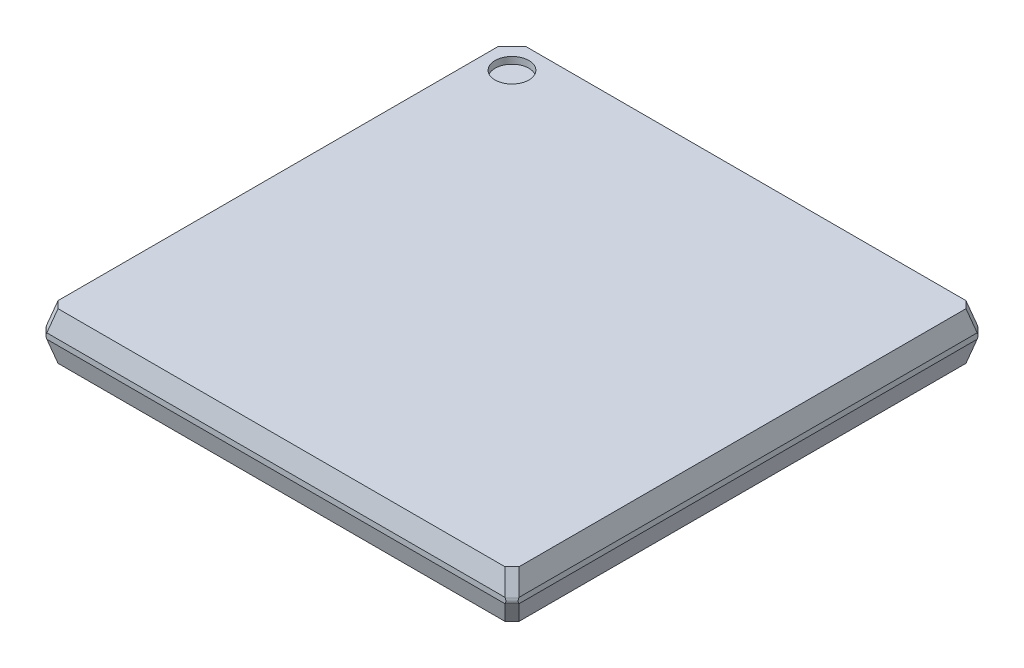
ISO-10303-21;
HEADER;
FILE_DESCRIPTION(('STEP AP214'),'2;1');
FILE_NAME('part.step','',(''),(''),'','','');
FILE_SCHEMA(('AUTOMOTIVE_DESIGN { 1 0 10303 214 1 1 1 1 }'));
ENDSEC;
DATA;
#1=APPLICATION_CONTEXT('core data for automotive mechanical design processes');
#2=APPLICATION_PROTOCOL_DEFINITION('international standard','automotive_design',2000,#1);
#3=PRODUCT_CONTEXT('',#1,'mechanical');
#4=PRODUCT('Part','Part','',(#3));
#5=PRODUCT_RELATED_PRODUCT_CATEGORY('part','',(#4));
#6=PRODUCT_DEFINITION_FORMATION('','',#4);
#7=PRODUCT_DEFINITION_CONTEXT('part definition',#1,'design');
#8=PRODUCT_DEFINITION('design','',#6,#7);
#9=PRODUCT_DEFINITION_SHAPE('','',#8);
#10=(LENGTH_UNIT() NAMED_UNIT(*) SI_UNIT(.MILLI.,.METRE.));
#11=(NAMED_UNIT(*) PLANE_ANGLE_UNIT() SI_UNIT($,.RADIAN.));
#12=(NAMED_UNIT(*) SI_UNIT($,.STERADIAN.) SOLID_ANGLE_UNIT());
#13=UNCERTAINTY_MEASURE_WITH_UNIT(LENGTH_MEASURE(1.E-05),#10,'distance_accuracy_value','');
#14=(GEOMETRIC_REPRESENTATION_CONTEXT(3) GLOBAL_UNCERTAINTY_ASSIGNED_CONTEXT((#13)) GLOBAL_UNIT_ASSIGNED_CONTEXT((#10,
#11,#12)) REPRESENTATION_CONTEXT('',''));
#15=CARTESIAN_POINT('',(0.,0.,0.));
#16=DIRECTION('',(0.,0.,1.));
#17=DIRECTION('',(1.,0.,0.));
#18=AXIS2_PLACEMENT_3D('',#15,#16,#17);
#19=CARTESIAN_POINT('',(-6.,0.5,-6.));
#20=DIRECTION('',(0.,1.,0.));
#21=DIRECTION('',(0.,0.,1.));
#22=AXIS2_PLACEMENT_3D('',#19,#20,#21);
#23=PLANE('',#22);
#24=CARTESIAN_POINT('',(-6.,0.5,-6.));
#25=DIRECTION('',(0.,-1.,0.));
#26=DIRECTION('',(0.,0.,-1.));
#27=AXIS2_PLACEMENT_3D('',#24,#25,#26);
#28=CIRCLE('',#27,0.5);
#29=CARTESIAN_POINT('',(-6.,0.5,-6.5));
#30=VERTEX_POINT('',#29);
#31=EDGE_CURVE('E19',#30,#30,#28,.F.);
#32=ORIENTED_EDGE('',*,*,#31,.T.);
#33=EDGE_LOOP('',(#32));
#34=FACE_BOUND('',#33,.T.);
#35=ADVANCED_FACE('F16',(#34),#23,.T.);
#36=CARTESIAN_POINT('',(-6.,0.7,-6.));
#37=DIRECTION('',(0.,-1.,0.));
#38=DIRECTION('',(0.,0.,-1.));
#39=AXIS2_PLACEMENT_3D('',#36,#37,#38);
#40=CYLINDRICAL_SURFACE('',#39,0.5);
#41=CARTESIAN_POINT('',(-6.,0.7,-6.));
#42=DIRECTION('',(0.,-1.,0.));
#43=DIRECTION('',(0.,0.,-1.));
#44=AXIS2_PLACEMENT_3D('',#41,#42,#43);
#45=CIRCLE('',#44,0.5);
#46=CARTESIAN_POINT('',(-6.,0.7,-6.5));
#47=VERTEX_POINT('',#46);
#48=EDGE_CURVE('E321',#47,#47,#45,.T.);
#49=ORIENTED_EDGE('',*,*,#48,.F.);
#50=EDGE_LOOP('',(#49));
#51=FACE_BOUND('',#50,.T.);
#52=ORIENTED_EDGE('',*,*,#31,.F.);
#53=EDGE_LOOP('',(#52));
#54=FACE_BOUND('',#53,.T.);
#55=ADVANCED_FACE('F376',(#51,#54),#40,.F.);
#56=CARTESIAN_POINT('',(0.,0.7,0.));
#57=DIRECTION('',(0.,1.,0.));
#58=DIRECTION('',(0.,0.,1.));
#59=AXIS2_PLACEMENT_3D('',#56,#57,#58);
#60=PLANE('',#59);
#61=ORIENTED_EDGE('',*,*,#48,.T.);
#62=EDGE_LOOP('',(#61));
#63=FACE_BOUND('',#62,.T.);
#64=DIRECTION('',(0.707106781186548,0.,0.707106781186548));
#65=VECTOR('',#64,1.);
#66=CARTESIAN_POINT('',(-6.70914048806276,0.699999999999998,6.70914048806276));
#67=LINE('',#66,#65);
#68=CARTESIAN_POINT('',(-6.60584541082731,0.699999999999998,6.81243556529822));
#69=VERTEX_POINT('',#68);
#70=CARTESIAN_POINT('',(-6.81243556529822,0.699999999999999,6.60584541082731));
#71=VERTEX_POINT('',#70);
#72=EDGE_CURVE('E296',#69,#71,#67,.F.);
#73=ORIENTED_EDGE('',*,*,#72,.F.);
#74=DIRECTION('',(1.,0.,0.));
#75=VECTOR('',#74,1.);
#76=CARTESIAN_POINT('',(-3.5,0.699999999999999,6.81243556529822));
#77=LINE('',#76,#75);
#78=CARTESIAN_POINT('',(6.60584541082731,0.699999999999999,6.81243556529822));
#79=VERTEX_POINT('',#78);
#80=EDGE_CURVE('E302',#79,#69,#77,.F.);
#81=ORIENTED_EDGE('',*,*,#80,.F.);
#82=DIRECTION('',(0.707106781186548,0.,-0.707106781186548));
#83=VECTOR('',#82,1.);
#84=CARTESIAN_POINT('',(6.60584541082731,0.7,6.81243556529822));
#85=LINE('',#84,#83);
#86=CARTESIAN_POINT('',(6.81243556529822,0.699999999999999,6.60584541082731));
#87=VERTEX_POINT('',#86);
#88=EDGE_CURVE('E328',#79,#87,#85,.T.);
#89=ORIENTED_EDGE('',*,*,#88,.T.);
#90=DIRECTION('',(0.,0.,1.));
#91=VECTOR('',#90,1.);
#92=CARTESIAN_POINT('',(6.81243556529822,0.699999999999999,3.5));
#93=LINE('',#92,#91);
#94=CARTESIAN_POINT('',(6.81243556529822,0.7,-6.60584541082732));
#95=VERTEX_POINT('',#94);
#96=EDGE_CURVE('E231',#95,#87,#93,.T.);
#97=ORIENTED_EDGE('',*,*,#96,.F.);
#98=DIRECTION('',(-0.70710678118655,0.,-0.707106781186545));
#99=VECTOR('',#98,1.);
#100=CARTESIAN_POINT('',(6.70914048806277,0.700000000000003,-6.70914048806276));
#101=LINE('',#100,#99);
#102=CARTESIAN_POINT('',(6.60584541082731,0.700000000000002,-6.81243556529822));
#103=VERTEX_POINT('',#102);
#104=EDGE_CURVE('E244',#103,#95,#101,.F.);
#105=ORIENTED_EDGE('',*,*,#104,.F.);
#106=DIRECTION('',(1.,0.,0.));
#107=VECTOR('',#106,1.);
#108=CARTESIAN_POINT('',(3.5,0.699999999999999,-6.81243556529822));
#109=LINE('',#108,#107);
#110=CARTESIAN_POINT('',(-6.39925525635641,0.7,-6.81243556529822));
#111=VERTEX_POINT('',#110);
#112=EDGE_CURVE('E257',#111,#103,#109,.T.);
#113=ORIENTED_EDGE('',*,*,#112,.F.);
#114=DIRECTION('',(-0.707106781186547,0.,0.707106781186548));
#115=VECTOR('',#114,1.);
#116=CARTESIAN_POINT('',(-6.60584541082731,0.699999999999999,-6.60584541082731));
#117=LINE('',#116,#115);
#118=CARTESIAN_POINT('',(-6.81243556529822,0.699999999999999,-6.39925525635641));
#119=VERTEX_POINT('',#118);
#120=EDGE_CURVE('E270',#119,#111,#117,.F.);
#121=ORIENTED_EDGE('',*,*,#120,.F.);
#122=DIRECTION('',(0.,0.,1.));
#123=VECTOR('',#122,1.);
#124=CARTESIAN_POINT('',(-6.81243556529822,0.699999999999999,-3.5));
#125=LINE('',#124,#123);
#126=EDGE_CURVE('E283',#71,#119,#125,.F.);
#127=ORIENTED_EDGE('',*,*,#126,.F.);
#128=EDGE_LOOP('',(#73,#81,#89,#97,#105,#113,#121,#127));
#129=FACE_BOUND('',#128,.T.);
#130=ADVANCED_FACE('F373',(#63,#129),#60,.T.);
#131=CARTESIAN_POINT('',(-3.5,0.35,6.90621778264911));
#132=DIRECTION('',(0.,0.258819045102521,0.965925826289068));
#133=DIRECTION('',(0.,-0.965925826289068,0.258819045102521));
#134=AXIS2_PLACEMENT_3D('',#131,#132,#133);
#135=PLANE('',#134);
#136=ORIENTED_EDGE('',*,*,#80,.T.);
#137=DIRECTION('',(0.250562807085732,0.93511312653103,-0.250562807085732));
#138=VECTOR('',#137,1.);
#139=CARTESIAN_POINT('',(-6.2790134803474,1.91975337008685,6.4856036348183));
#140=LINE('',#139,#138);
#141=CARTESIAN_POINT('',(-6.77141022669538,0.0821036952345704,6.97800038116629));
#142=VERTEX_POINT('',#141);
#143=EDGE_CURVE('E299',#142,#69,#140,.T.);
#144=ORIENTED_EDGE('',*,*,#143,.F.);
#145=DIRECTION('',(1.,0.,0.));
#146=VECTOR('',#145,1.);
#147=CARTESIAN_POINT('',(-3.5,0.0821036952345708,6.97800038116629));
#148=LINE('',#147,#146);
#149=CARTESIAN_POINT('',(6.77141022669538,0.0821036952345713,6.97800038116629));
#150=VERTEX_POINT('',#149);
#151=EDGE_CURVE('E305',#150,#142,#148,.F.);
#152=ORIENTED_EDGE('',*,*,#151,.F.);
#153=DIRECTION('',(-0.250562807085731,0.93511312653103,-0.250562807085731));
#154=VECTOR('',#153,1.);
#155=CARTESIAN_POINT('',(6.2790134803474,1.91975337008684,6.48560363481831));
#156=LINE('',#155,#154);
#157=EDGE_CURVE('E218',#79,#150,#156,.F.);
#158=ORIENTED_EDGE('',*,*,#157,.F.);
#159=EDGE_LOOP('',(#136,#144,#152,#158));
#160=FACE_BOUND('',#159,.T.);
#161=ADVANCED_FACE('F478',(#160),#135,.T.);
#162=CARTESIAN_POINT('',(-6.38230855758285,1.91975337008685,6.38230855758285));
#163=DIRECTION('',(-0.661224832946645,0.354349320006915,0.661224832946645));
#164=DIRECTION('',(0.707106781186548,0.,0.707106781186548));
#165=AXIS2_PLACEMENT_3D('',#162,#163,#164);
#166=PLANE('',#165);
#167=ORIENTED_EDGE('',*,*,#72,.T.);
#168=DIRECTION('',(0.250562807085732,0.935113126531029,-0.250562807085731));
#169=VECTOR('',#168,1.);
#170=CARTESIAN_POINT('',(-6.97800038116629,0.0821036952345706,6.77141022669538));
#171=LINE('',#170,#169);
#172=CARTESIAN_POINT('',(-6.97800038116629,0.082103695234571,6.77141022669538));
#173=VERTEX_POINT('',#172);
#174=EDGE_CURVE('E293',#173,#71,#171,.T.);
#175=ORIENTED_EDGE('',*,*,#174,.F.);
#176=DIRECTION('',(0.,0.881412416655406,-0.472347490483095));
#177=VECTOR('',#176,1.);
#178=CARTESIAN_POINT('',(-6.97800038116629,0.0708698640013826,6.77743041870906));
#179=LINE('',#178,#177);
#180=CARTESIAN_POINT('',(-6.97800038116629,0.0708698640013788,6.77743041870907));
#181=VERTEX_POINT('',#180);
#182=EDGE_CURVE('E290',#181,#173,#179,.T.);
#183=ORIENTED_EDGE('',*,*,#182,.F.);
#184=DIRECTION('',(-0.707106781186548,0.,-0.707106781186548));
#185=VECTOR('',#184,1.);
#186=CARTESIAN_POINT('',(-6.87771539993768,0.0708698640013844,6.87771539993768));
#187=LINE('',#186,#185);
#188=CARTESIAN_POINT('',(-6.77743041870907,0.0708698640013796,6.97800038116629));
#189=VERTEX_POINT('',#188);
#190=EDGE_CURVE('E369',#189,#181,#187,.T.);
#191=ORIENTED_EDGE('',*,*,#190,.F.);
#192=DIRECTION('',(-0.472347490483105,-0.8814124166554,0.));
#193=VECTOR('',#192,1.);
#194=CARTESIAN_POINT('',(-6.77141022669538,0.0821036952345708,6.97800038116629));
#195=LINE('',#194,#193);
#196=EDGE_CURVE('E308',#142,#189,#195,.T.);
#197=ORIENTED_EDGE('',*,*,#196,.F.);
#198=ORIENTED_EDGE('',*,*,#143,.T.);
#199=EDGE_LOOP('',(#167,#175,#183,#191,#197,#198));
#200=FACE_BOUND('',#199,.T.);
#201=ADVANCED_FACE('F474',(#200),#166,.T.);
#202=CARTESIAN_POINT('',(-6.90621778264911,0.35,-3.5));
#203=DIRECTION('',(-0.965925826289068,0.258819045102521,0.));
#204=DIRECTION('',(-0.258819045102521,-0.965925826289068,0.));
#205=AXIS2_PLACEMENT_3D('',#202,#203,#204);
#206=PLANE('',#205);
#207=ORIENTED_EDGE('',*,*,#126,.T.);
#208=DIRECTION('',(0.250562807085731,0.93511312653103,0.250562807085731));
#209=VECTOR('',#208,1.);
#210=CARTESIAN_POINT('',(-6.49857372011194,1.87134835279253,-6.08539341117013));
#211=LINE('',#210,#209);
#212=CARTESIAN_POINT('',(-6.97800038116629,0.0821036952345714,-6.56482007222448));
#213=VERTEX_POINT('',#212);
#214=EDGE_CURVE('E280',#213,#119,#211,.T.);
#215=ORIENTED_EDGE('',*,*,#214,.F.);
#216=DIRECTION('',(0.,0.,1.));
#217=VECTOR('',#216,1.);
#218=CARTESIAN_POINT('',(-6.97800038116629,0.0821036952345711,-3.5));
#219=LINE('',#218,#217);
#220=EDGE_CURVE('E286',#173,#213,#219,.F.);
#221=ORIENTED_EDGE('',*,*,#220,.F.);
#222=ORIENTED_EDGE('',*,*,#174,.T.);
#223=EDGE_LOOP('',(#207,#215,#221,#222));
#224=FACE_BOUND('',#223,.T.);
#225=ADVANCED_FACE('F470',(#224),#206,.T.);
#226=CARTESIAN_POINT('',(-6.29198356564103,1.87134835279253,-6.29198356564103));
#227=DIRECTION('',(-0.661224832946645,0.354349320006915,-0.661224832946645));
#228=DIRECTION('',(-0.707106781186547,0.,0.707106781186548));
#229=AXIS2_PLACEMENT_3D('',#226,#227,#228);
#230=PLANE('',#229);
#231=ORIENTED_EDGE('',*,*,#120,.T.);
#232=DIRECTION('',(0.250562807085728,0.93511312653103,0.250562807085732));
#233=VECTOR('',#232,1.);
#234=CARTESIAN_POINT('',(-6.56482007222448,0.0821036952345708,-6.97800038116629));
#235=LINE('',#234,#233);
#236=CARTESIAN_POINT('',(-6.56482007222448,0.082103695234571,-6.97800038116629));
#237=VERTEX_POINT('',#236);
#238=EDGE_CURVE('E267',#237,#111,#235,.T.);
#239=ORIENTED_EDGE('',*,*,#238,.F.);
#240=DIRECTION('',(0.472347490483115,0.881412416655395,0.));
#241=VECTOR('',#240,1.);
#242=CARTESIAN_POINT('',(-6.57084026423816,0.0708698640013832,-6.97800038116629));
#243=LINE('',#242,#241);
#244=CARTESIAN_POINT('',(-6.57084026423816,0.0708698640013806,-6.97800038116629));
#245=VERTEX_POINT('',#244);
#246=EDGE_CURVE('E264',#245,#237,#243,.T.);
#247=ORIENTED_EDGE('',*,*,#246,.F.);
#248=DIRECTION('',(0.707106781186548,0.,-0.707106781186547));
#249=VECTOR('',#248,1.);
#250=CARTESIAN_POINT('',(-6.77442032270222,0.070869864001383,-6.77442032270223));
#251=LINE('',#250,#249);
#252=CARTESIAN_POINT('',(-6.97800038116629,0.0708698640013806,-6.57084026423816));
#253=VERTEX_POINT('',#252);
#254=EDGE_CURVE('E362',#253,#245,#251,.T.);
#255=ORIENTED_EDGE('',*,*,#254,.F.);
#256=DIRECTION('',(0.,-0.881412416655395,-0.472347490483115));
#257=VECTOR('',#256,1.);
#258=CARTESIAN_POINT('',(-6.97800038116629,0.0821036952345711,-6.56482007222448));
#259=LINE('',#258,#257);
#260=EDGE_CURVE('E289',#213,#253,#259,.T.);
#261=ORIENTED_EDGE('',*,*,#260,.F.);
#262=ORIENTED_EDGE('',*,*,#214,.T.);
#263=EDGE_LOOP('',(#231,#239,#247,#255,#261,#262));
#264=FACE_BOUND('',#263,.T.);
#265=ADVANCED_FACE('F466',(#264),#230,.T.);
#266=CARTESIAN_POINT('',(3.5,0.35,-6.90621778264911));
#267=DIRECTION('',(0.,0.258819045102521,-0.965925826289068));
#268=DIRECTION('',(0.,0.965925826289068,0.258819045102521));
#269=AXIS2_PLACEMENT_3D('',#266,#267,#268);
#270=PLANE('',#269);
#271=ORIENTED_EDGE('',*,*,#112,.T.);
#272=DIRECTION('',(-0.25056280708573,0.93511312653103,0.250562807085732));
#273=VECTOR('',#272,1.);
#274=CARTESIAN_POINT('',(6.2790134803474,1.91975337008685,-6.48560363481831));
#275=LINE('',#274,#273);
#276=CARTESIAN_POINT('',(6.77141022669538,0.0821036952345713,-6.97800038116629));
#277=VERTEX_POINT('',#276);
#278=EDGE_CURVE('E254',#277,#103,#275,.T.);
#279=ORIENTED_EDGE('',*,*,#278,.F.);
#280=DIRECTION('',(-1.,0.,0.));
#281=VECTOR('',#280,1.);
#282=CARTESIAN_POINT('',(3.5,0.0821036952345711,-6.97800038116629));
#283=LINE('',#282,#281);
#284=EDGE_CURVE('E260',#237,#277,#283,.F.);
#285=ORIENTED_EDGE('',*,*,#284,.F.);
#286=ORIENTED_EDGE('',*,*,#238,.T.);
#287=EDGE_LOOP('',(#271,#279,#285,#286));
#288=FACE_BOUND('',#287,.T.);
#289=ADVANCED_FACE('F462',(#288),#270,.T.);
#290=CARTESIAN_POINT('',(6.38230855758286,1.91975337008685,-6.38230855758285));
#291=DIRECTION('',(0.661224832946643,0.354349320006914,-0.661224832946647));
#292=DIRECTION('',(-0.70710678118655,0.,-0.707106781186545));
#293=AXIS2_PLACEMENT_3D('',#290,#291,#292);
#294=PLANE('',#293);
#295=ORIENTED_EDGE('',*,*,#104,.T.);
#296=DIRECTION('',(-0.25056280708573,0.93511312653103,0.250562807085731));
#297=VECTOR('',#296,1.);
#298=CARTESIAN_POINT('',(6.97800038116629,0.0821036952345711,-6.77141022669538));
#299=LINE('',#298,#297);
#300=CARTESIAN_POINT('',(6.97800038116629,0.0821036952345716,-6.77141022669538));
#301=VERTEX_POINT('',#300);
#302=EDGE_CURVE('E241',#301,#95,#299,.T.);
#303=ORIENTED_EDGE('',*,*,#302,.F.);
#304=DIRECTION('',(0.,0.881412416655397,0.472347490483112));
#305=VECTOR('',#304,1.);
#306=CARTESIAN_POINT('',(6.97800038116629,0.0708698640013836,-6.77743041870906));
#307=LINE('',#306,#305);
#308=CARTESIAN_POINT('',(6.97800038116629,0.0708698640013795,-6.77743041870906));
#309=VERTEX_POINT('',#308);
#310=EDGE_CURVE('E238',#309,#301,#307,.T.);
#311=ORIENTED_EDGE('',*,*,#310,.F.);
#312=DIRECTION('',(-0.707106781186549,0.,-0.707106781186546));
#313=VECTOR('',#312,1.);
#314=CARTESIAN_POINT('',(6.87771539993768,0.0708698640013808,-6.87771539993767));
#315=LINE('',#314,#313);
#316=CARTESIAN_POINT('',(6.77743041870904,0.0708698640014305,-6.97800038116629));
#317=VERTEX_POINT('',#316);
#318=EDGE_CURVE('E354',#317,#309,#315,.F.);
#319=ORIENTED_EDGE('',*,*,#318,.F.);
#320=DIRECTION('',(0.47234749048371,-0.881412416655076,0.));
#321=VECTOR('',#320,1.);
#322=CARTESIAN_POINT('',(6.77141022669538,0.0821036952345711,-6.97800038116629));
#323=LINE('',#322,#321);
#324=EDGE_CURVE('E263',#277,#317,#323,.T.);
#325=ORIENTED_EDGE('',*,*,#324,.F.);
#326=ORIENTED_EDGE('',*,*,#278,.T.);
#327=EDGE_LOOP('',(#295,#303,#311,#319,#325,#326));
#328=FACE_BOUND('',#327,.T.);
#329=ADVANCED_FACE('F458',(#328),#294,.T.);
#330=CARTESIAN_POINT('',(6.90621778264911,0.35,3.5));
#331=DIRECTION('',(0.965925826289069,0.258819045102519,0.));
#332=DIRECTION('',(-0.258819045102519,0.965925826289069,0.));
#333=AXIS2_PLACEMENT_3D('',#330,#331,#332);
#334=PLANE('',#333);
#335=ORIENTED_EDGE('',*,*,#96,.T.);
#336=DIRECTION('',(-0.250562807085731,0.93511312653103,-0.250562807085731));
#337=VECTOR('',#336,1.);
#338=CARTESIAN_POINT('',(6.48560363481831,1.91975337008684,6.2790134803474));
#339=LINE('',#338,#337);
#340=CARTESIAN_POINT('',(6.97800038116629,0.082103695234571,6.77141022669538));
#341=VERTEX_POINT('',#340);
#342=EDGE_CURVE('E228',#341,#87,#339,.T.);
#343=ORIENTED_EDGE('',*,*,#342,.F.);
#344=DIRECTION('',(0.,0.,-1.));
#345=VECTOR('',#344,1.);
#346=CARTESIAN_POINT('',(6.97800038116629,0.0821036952345716,3.5));
#347=LINE('',#346,#345);
#348=EDGE_CURVE('E234',#301,#341,#347,.F.);
#349=ORIENTED_EDGE('',*,*,#348,.F.);
#350=ORIENTED_EDGE('',*,*,#302,.T.);
#351=EDGE_LOOP('',(#335,#343,#349,#350));
#352=FACE_BOUND('',#351,.T.);
#353=ADVANCED_FACE('F454',(#352),#334,.T.);
#354=CARTESIAN_POINT('',(6.38230855758286,1.91975337008684,6.38230855758285));
#355=DIRECTION('',(0.661224832946645,0.354349320006914,0.661224832946645));
#356=DIRECTION('',(0.707106781186548,0.,-0.707106781186548));
#357=AXIS2_PLACEMENT_3D('',#354,#355,#356);
#358=PLANE('',#357);
#359=DIRECTION('',(-0.472347490483131,0.881412416655386,0.));
#360=VECTOR('',#359,1.);
#361=CARTESIAN_POINT('',(6.77743041870906,0.0708698640013834,6.97800038116629));
#362=LINE('',#361,#360);
#363=CARTESIAN_POINT('',(6.77743041870906,0.0708698640013824,6.97800038116629));
#364=VERTEX_POINT('',#363);
#365=EDGE_CURVE('E187',#364,#150,#362,.T.);
#366=ORIENTED_EDGE('',*,*,#365,.F.);
#367=DIRECTION('',(0.707106781186547,0.,-0.707106781186548));
#368=VECTOR('',#367,1.);
#369=CARTESIAN_POINT('',(6.87771539993768,0.070869864001383,6.87771539993767));
#370=LINE('',#369,#368);
#371=CARTESIAN_POINT('',(6.97800038116629,0.0708698640013791,6.77743041870906));
#372=VERTEX_POINT('',#371);
#373=EDGE_CURVE('E183',#372,#364,#370,.F.);
#374=ORIENTED_EDGE('',*,*,#373,.F.);
#375=DIRECTION('',(0.,-0.881412416655405,0.472347490483096));
#376=VECTOR('',#375,1.);
#377=CARTESIAN_POINT('',(6.97800038116629,0.0821036952345719,6.77141022669538));
#378=LINE('',#377,#376);
#379=EDGE_CURVE('E237',#341,#372,#378,.T.);
#380=ORIENTED_EDGE('',*,*,#379,.F.);
#381=ORIENTED_EDGE('',*,*,#342,.T.);
#382=ORIENTED_EDGE('',*,*,#88,.F.);
#383=ORIENTED_EDGE('',*,*,#157,.T.);
#384=EDGE_LOOP('',(#366,#374,#380,#381,#382,#383));
#385=FACE_BOUND('',#384,.T.);
#386=ADVANCED_FACE('F451',(#385),#358,.T.);
#387=CARTESIAN_POINT('',(6.74547043334835,0.,6.74547043334834));
#388=DIRECTION('',(0.707106781186547,0.,-0.707106781186548));
#389=DIRECTION('',(-0.707106781186548,0.,-0.707106781186547));
#390=AXIS2_PLACEMENT_3D('',#387,#388,#389);
#391=CYLINDRICAL_SURFACE('',#390,0.2);
#392=CARTESIAN_POINT('',(6.5129404855304,0.,6.97800038116629));
#393=DIRECTION('',(0.,0.,1.));
#394=DIRECTION('',(1.,0.,0.));
#395=AXIS2_PLACEMENT_3D('',#392,#393,#394);
#396=ELLIPSE('',#395,0.282842712474619,0.2);
#397=CARTESIAN_POINT('',(6.77743041870906,-0.0708698640013771,6.97800038116629));
#398=VERTEX_POINT('',#397);
#399=EDGE_CURVE('E176',#398,#364,#396,.T.);
#400=ORIENTED_EDGE('',*,*,#399,.F.);
#401=DIRECTION('',(0.707106781186548,0.,-0.707106781186548));
#402=VECTOR('',#401,1.);
#403=CARTESIAN_POINT('',(6.87771539993768,-0.0708698640013812,6.87771539993767));
#404=LINE('',#403,#402);
#405=CARTESIAN_POINT('',(6.97800038116629,-0.0708698640013795,6.77743041870906));
#406=VERTEX_POINT('',#405);
#407=EDGE_CURVE('E181',#406,#398,#404,.F.);
#408=ORIENTED_EDGE('',*,*,#407,.F.);
#409=CARTESIAN_POINT('',(6.97800038116629,0.,6.5129404855304));
#410=DIRECTION('',(1.,0.,0.));
#411=DIRECTION('',(0.,0.,-1.));
#412=AXIS2_PLACEMENT_3D('',#409,#410,#411);
#413=ELLIPSE('',#412,0.282842712474619,0.2);
#414=EDGE_CURVE('E349',#372,#406,#413,.T.);
#415=ORIENTED_EDGE('',*,*,#414,.F.);
#416=ORIENTED_EDGE('',*,*,#373,.T.);
#417=EDGE_LOOP('',(#400,#408,#415,#416));
#418=FACE_BOUND('',#417,.T.);
#419=ADVANCED_FACE('F178',(#418),#391,.T.);
#420=CARTESIAN_POINT('',(-3.5,0.,6.97800038116629));
#421=DIRECTION('',(0.,0.,1.));
#422=DIRECTION('',(1.,0.,0.));
#423=AXIS2_PLACEMENT_3D('',#420,#421,#422);
#424=PLANE('',#423);
#425=ORIENTED_EDGE('',*,*,#196,.T.);
#426=CARTESIAN_POINT('',(-6.51294048553041,0.,6.97800038116629));
#427=DIRECTION('',(0.,0.,1.));
#428=DIRECTION('',(-1.,0.,0.));
#429=AXIS2_PLACEMENT_3D('',#426,#427,#428);
#430=ELLIPSE('',#429,0.282842712474619,0.2);
#431=CARTESIAN_POINT('',(-6.77743041870906,-0.0708698640013803,6.97800038116629));
#432=VERTEX_POINT('',#431);
#433=EDGE_CURVE('E367',#432,#189,#430,.F.);
#434=ORIENTED_EDGE('',*,*,#433,.F.);
#435=DIRECTION('',(0.472347490483118,-0.881412416655393,0.));
#436=VECTOR('',#435,1.);
#437=CARTESIAN_POINT('',(-6.77743041870906,-0.0708698640013833,6.97800038116629));
#438=LINE('',#437,#436);
#439=CARTESIAN_POINT('',(-6.77141022669538,-0.0821036952345709,6.97800038116629));
#440=VERTEX_POINT('',#439);
#441=EDGE_CURVE('E188',#432,#440,#438,.T.);
#442=ORIENTED_EDGE('',*,*,#441,.T.);
#443=DIRECTION('',(1.,0.,0.));
#444=VECTOR('',#443,1.);
#445=CARTESIAN_POINT('',(-3.5,-0.0821036952345706,6.97800038116629));
#446=LINE('',#445,#444);
#447=CARTESIAN_POINT('',(6.77141022669538,-0.0821036952345688,6.97800038116629));
#448=VERTEX_POINT('',#447);
#449=EDGE_CURVE('E194',#448,#440,#446,.F.);
#450=ORIENTED_EDGE('',*,*,#449,.F.);
#451=DIRECTION('',(-0.472347490483091,-0.881412416655408,0.));
#452=VECTOR('',#451,1.);
#453=CARTESIAN_POINT('',(6.77743041870906,-0.0708698640013812,6.97800038116629));
#454=LINE('',#453,#452);
#455=EDGE_CURVE('E191',#398,#448,#454,.T.);
#456=ORIENTED_EDGE('',*,*,#455,.F.);
#457=ORIENTED_EDGE('',*,*,#399,.T.);
#458=ORIENTED_EDGE('',*,*,#365,.T.);
#459=ORIENTED_EDGE('',*,*,#151,.T.);
#460=EDGE_LOOP('',(#425,#434,#442,#450,#456,#457,#458,#459));
#461=FACE_BOUND('',#460,.T.);
#462=ADVANCED_FACE('F192',(#461),#424,.T.);
#463=CARTESIAN_POINT('',(-6.74547043334835,0.,6.74547043334835));
#464=DIRECTION('',(-0.707106781186548,0.,-0.707106781186548));
#465=DIRECTION('',(-0.707106781186548,0.,0.707106781186548));
#466=AXIS2_PLACEMENT_3D('',#463,#464,#465);
#467=CYLINDRICAL_SURFACE('',#466,0.2);
#468=ORIENTED_EDGE('',*,*,#433,.T.);
#469=ORIENTED_EDGE('',*,*,#190,.T.);
#470=CARTESIAN_POINT('',(-6.97800038116629,0.,6.51294048553041));
#471=DIRECTION('',(-1.,0.,0.));
#472=DIRECTION('',(0.,0.,-1.));
#473=AXIS2_PLACEMENT_3D('',#470,#471,#472);
#474=ELLIPSE('',#473,0.282842712474619,0.2);
#475=CARTESIAN_POINT('',(-6.97800038116629,-0.0708698640013854,6.77743041870906));
#476=VERTEX_POINT('',#475);
#477=EDGE_CURVE('E363',#476,#181,#474,.T.);
#478=ORIENTED_EDGE('',*,*,#477,.F.);
#479=DIRECTION('',(0.707106781186548,0.,0.707106781186548));
#480=VECTOR('',#479,1.);
#481=CARTESIAN_POINT('',(-6.87771539993767,-0.0708698640013818,6.87771539993767));
#482=LINE('',#481,#480);
#483=EDGE_CURVE('E317',#432,#476,#482,.F.);
#484=ORIENTED_EDGE('',*,*,#483,.F.);
#485=EDGE_LOOP('',(#468,#469,#478,#484));
#486=FACE_BOUND('',#485,.T.);
#487=ADVANCED_FACE('F442',(#486),#467,.T.);
#488=CARTESIAN_POINT('',(-6.97800038116629,0.,-3.5));
#489=DIRECTION('',(-1.,0.,0.));
#490=DIRECTION('',(0.,0.,1.));
#491=AXIS2_PLACEMENT_3D('',#488,#489,#490);
#492=PLANE('',#491);
#493=DIRECTION('',(0.,-0.881412416655361,-0.472347490483179));
#494=VECTOR('',#493,1.);
#495=CARTESIAN_POINT('',(-6.97800038116629,-0.0708698640013818,6.77743041870906));
#496=LINE('',#495,#494);
#497=CARTESIAN_POINT('',(-6.97800038116629,-0.0821036952345675,6.77141022669538));
#498=VERTEX_POINT('',#497);
#499=EDGE_CURVE('E215',#476,#498,#496,.T.);
#500=ORIENTED_EDGE('',*,*,#499,.F.);
#501=ORIENTED_EDGE('',*,*,#477,.T.);
#502=ORIENTED_EDGE('',*,*,#182,.T.);
#503=ORIENTED_EDGE('',*,*,#220,.T.);
#504=ORIENTED_EDGE('',*,*,#260,.T.);
#505=CARTESIAN_POINT('',(-6.97800038116629,0.,-6.3063503310595));
#506=DIRECTION('',(-1.,0.,0.));
#507=DIRECTION('',(0.,0.,-1.));
#508=AXIS2_PLACEMENT_3D('',#505,#506,#507);
#509=ELLIPSE('',#508,0.282842712474619,0.2);
#510=CARTESIAN_POINT('',(-6.97800038116629,-0.0708698640013794,-6.57084026423816));
#511=VERTEX_POINT('',#510);
#512=EDGE_CURVE('E359',#511,#253,#509,.F.);
#513=ORIENTED_EDGE('',*,*,#512,.F.);
#514=DIRECTION('',(0.,-0.8814124166554,0.472347490483105));
#515=VECTOR('',#514,1.);
#516=CARTESIAN_POINT('',(-6.97800038116629,-0.0708698640013826,-6.57084026423816));
#517=LINE('',#516,#515);
#518=CARTESIAN_POINT('',(-6.97800038116629,-0.0821036952345706,-6.56482007222448));
#519=VERTEX_POINT('',#518);
#520=EDGE_CURVE('E366',#511,#519,#517,.T.);
#521=ORIENTED_EDGE('',*,*,#520,.T.);
#522=DIRECTION('',(0.,0.,1.));
#523=VECTOR('',#522,1.);
#524=CARTESIAN_POINT('',(-6.97800038116629,-0.0821036952345704,-3.5));
#525=LINE('',#524,#523);
#526=EDGE_CURVE('E754',#498,#519,#525,.F.);
#527=ORIENTED_EDGE('',*,*,#526,.F.);
#528=EDGE_LOOP('',(#500,#501,#502,#503,#504,#513,#521,#527));
#529=FACE_BOUND('',#528,.T.);
#530=ADVANCED_FACE('F438',(#529),#492,.T.);
#531=CARTESIAN_POINT('',(-6.64217535611289,0.,-6.6421753561129));
#532=DIRECTION('',(0.707106781186548,0.,-0.707106781186547));
#533=DIRECTION('',(-0.707106781186547,0.,-0.707106781186548));
#534=AXIS2_PLACEMENT_3D('',#531,#532,#533);
#535=CYLINDRICAL_SURFACE('',#534,0.2);
#536=ORIENTED_EDGE('',*,*,#512,.T.);
#537=ORIENTED_EDGE('',*,*,#254,.T.);
#538=CARTESIAN_POINT('',(-6.3063503310595,0.,-6.97800038116629));
#539=DIRECTION('',(0.,0.,-1.));
#540=DIRECTION('',(1.,0.,0.));
#541=AXIS2_PLACEMENT_3D('',#538,#539,#540);
#542=ELLIPSE('',#541,0.282842712474619,0.2);
#543=CARTESIAN_POINT('',(-6.57084026423816,-0.0708698640013832,-6.97800038116629));
#544=VERTEX_POINT('',#543);
#545=EDGE_CURVE('E355',#544,#245,#542,.T.);
#546=ORIENTED_EDGE('',*,*,#545,.F.);
#547=DIRECTION('',(-0.707106781186547,0.,0.707106781186548));
#548=VECTOR('',#547,1.);
#549=CARTESIAN_POINT('',(-6.77442032270223,-0.0708698640013829,-6.77442032270223));
#550=LINE('',#549,#548);
#551=EDGE_CURVE('E276',#511,#544,#550,.F.);
#552=ORIENTED_EDGE('',*,*,#551,.F.);
#553=EDGE_LOOP('',(#536,#537,#546,#552));
#554=FACE_BOUND('',#553,.T.);
#555=ADVANCED_FACE('F434',(#554),#535,.T.);
#556=CARTESIAN_POINT('',(3.5,0.,-6.97800038116629));
#557=DIRECTION('',(0.,0.,-1.));
#558=DIRECTION('',(-1.,0.,0.));
#559=AXIS2_PLACEMENT_3D('',#556,#557,#558);
#560=PLANE('',#559);
#561=DIRECTION('',(0.472347490483151,-0.881412416655376,0.));
#562=VECTOR('',#561,1.);
#563=CARTESIAN_POINT('',(-6.57084026423816,-0.0708698640013831,-6.97800038116629));
#564=LINE('',#563,#562);
#565=CARTESIAN_POINT('',(-6.56482007222448,-0.0821036952345717,-6.97800038116629));
#566=VERTEX_POINT('',#565);
#567=EDGE_CURVE('E277',#544,#566,#564,.T.);
#568=ORIENTED_EDGE('',*,*,#567,.F.);
#569=ORIENTED_EDGE('',*,*,#545,.T.);
#570=ORIENTED_EDGE('',*,*,#246,.T.);
#571=ORIENTED_EDGE('',*,*,#284,.T.);
#572=ORIENTED_EDGE('',*,*,#324,.T.);
#573=CARTESIAN_POINT('',(6.5129404855304,0.,-6.97800038116629));
#574=DIRECTION('',(0.,0.,-1.));
#575=DIRECTION('',(-1.,0.,0.));
#576=AXIS2_PLACEMENT_3D('',#573,#574,#575);
#577=ELLIPSE('',#576,0.28284271247462,0.2);
#578=CARTESIAN_POINT('',(6.77743041870904,-0.0708698640014275,-6.97800038116629));
#579=VERTEX_POINT('',#578);
#580=EDGE_CURVE('E351',#579,#317,#577,.F.);
#581=ORIENTED_EDGE('',*,*,#580,.F.);
#582=DIRECTION('',(-0.472347490483687,-0.881412416655089,0.));
#583=VECTOR('',#582,1.);
#584=CARTESIAN_POINT('',(6.77743041870907,-0.0708698640013823,-6.97800038116629));
#585=LINE('',#584,#583);
#586=CARTESIAN_POINT('',(6.77141022669538,-0.0821036952345705,-6.97800038116629));
#587=VERTEX_POINT('',#586);
#588=EDGE_CURVE('E358',#579,#587,#585,.T.);
#589=ORIENTED_EDGE('',*,*,#588,.T.);
#590=DIRECTION('',(1.,0.,0.));
#591=VECTOR('',#590,1.);
#592=CARTESIAN_POINT('',(3.5,-0.0821036952345706,-6.97800038116629));
#593=LINE('',#592,#591);
#594=EDGE_CURVE('E729',#566,#587,#593,.T.);
#595=ORIENTED_EDGE('',*,*,#594,.F.);
#596=EDGE_LOOP('',(#568,#569,#570,#571,#572,#581,#589,#595));
#597=FACE_BOUND('',#596,.T.);
#598=ADVANCED_FACE('F430',(#597),#560,.T.);
#599=CARTESIAN_POINT('',(6.74547043334835,0.,-6.74547043334834));
#600=DIRECTION('',(-0.707106781186549,0.,-0.707106781186546));
#601=DIRECTION('',(-0.707106781186546,0.,0.707106781186549));
#602=AXIS2_PLACEMENT_3D('',#599,#600,#601);
#603=CYLINDRICAL_SURFACE('',#602,0.2);
#604=ORIENTED_EDGE('',*,*,#580,.T.);
#605=ORIENTED_EDGE('',*,*,#318,.T.);
#606=CARTESIAN_POINT('',(6.97800038116629,0.,-6.5129404855304));
#607=DIRECTION('',(1.,0.,0.));
#608=DIRECTION('',(0.,0.,-1.));
#609=AXIS2_PLACEMENT_3D('',#606,#607,#608);
#610=ELLIPSE('',#609,0.282842712474618,0.2);
#611=CARTESIAN_POINT('',(6.97800038116629,-0.0708698640013805,-6.77743041870906));
#612=VERTEX_POINT('',#611);
#613=EDGE_CURVE('E202',#612,#309,#610,.T.);
#614=ORIENTED_EDGE('',*,*,#613,.F.);
#615=DIRECTION('',(-0.70710678118655,0.,-0.707106781186545));
#616=VECTOR('',#615,1.);
#617=CARTESIAN_POINT('',(6.87771539993768,-0.0708698640013807,-6.87771539993767));
#618=LINE('',#617,#616);
#619=EDGE_CURVE('E250',#579,#612,#618,.F.);
#620=ORIENTED_EDGE('',*,*,#619,.F.);
#621=EDGE_LOOP('',(#604,#605,#614,#620));
#622=FACE_BOUND('',#621,.T.);
#623=ADVANCED_FACE('F426',(#622),#603,.T.);
#624=CARTESIAN_POINT('',(6.97800038116629,0.,3.5));
#625=DIRECTION('',(1.,0.,0.));
#626=DIRECTION('',(0.,0.,-1.));
#627=AXIS2_PLACEMENT_3D('',#624,#625,#626);
#628=PLANE('',#627);
#629=DIRECTION('',(0.,-0.881412416655385,0.472347490483133));
#630=VECTOR('',#629,1.);
#631=CARTESIAN_POINT('',(6.97800038116629,-0.0708698640013836,-6.77743041870906));
#632=LINE('',#631,#630);
#633=CARTESIAN_POINT('',(6.97800038116629,-0.0821036952345709,-6.77141022669538));
#634=VERTEX_POINT('',#633);
#635=EDGE_CURVE('E251',#612,#634,#632,.T.);
#636=ORIENTED_EDGE('',*,*,#635,.F.);
#637=ORIENTED_EDGE('',*,*,#613,.T.);
#638=ORIENTED_EDGE('',*,*,#310,.T.);
#639=ORIENTED_EDGE('',*,*,#348,.T.);
#640=ORIENTED_EDGE('',*,*,#379,.T.);
#641=ORIENTED_EDGE('',*,*,#414,.T.);
#642=DIRECTION('',(0.,0.881412416655393,0.472347490483119));
#643=VECTOR('',#642,1.);
#644=CARTESIAN_POINT('',(6.97800038116629,-0.082103695234569,6.77141022669538));
#645=LINE('',#644,#643);
#646=CARTESIAN_POINT('',(6.97800038116629,-0.0821036952345684,6.77141022669538));
#647=VERTEX_POINT('',#646);
#648=EDGE_CURVE('E200',#647,#406,#645,.T.);
#649=ORIENTED_EDGE('',*,*,#648,.F.);
#650=DIRECTION('',(0.,0.,1.));
#651=VECTOR('',#650,1.);
#652=CARTESIAN_POINT('',(6.97800038116629,-0.0821036952345693,3.5));
#653=LINE('',#652,#651);
#654=EDGE_CURVE('E225',#634,#647,#653,.T.);
#655=ORIENTED_EDGE('',*,*,#654,.F.);
#656=EDGE_LOOP('',(#636,#637,#638,#639,#640,#641,#649,#655));
#657=FACE_BOUND('',#656,.T.);
#658=ADVANCED_FACE('F423',(#657),#628,.T.);
#659=CARTESIAN_POINT('',(6.38230855758286,-1.91975337008684,6.38230855758285));
#660=DIRECTION('',(0.661224832946645,-0.354349320006914,0.661224832946645));
#661=DIRECTION('',(0.707106781186548,0.,-0.707106781186548));
#662=AXIS2_PLACEMENT_3D('',#659,#660,#661);
#663=PLANE('',#662);
#664=DIRECTION('',(-0.707106781186548,0.,0.707106781186548));
#665=VECTOR('',#664,1.);
#666=CARTESIAN_POINT('',(6.81243556529822,-0.7,6.60584541082731));
#667=LINE('',#666,#665);
#668=CARTESIAN_POINT('',(6.81243556529822,-0.699999999999999,6.60584541082731));
#669=VERTEX_POINT('',#668);
#670=CARTESIAN_POINT('',(6.60584541082731,-0.699999999999999,6.81243556529822));
#671=VERTEX_POINT('',#670);
#672=EDGE_CURVE('E687',#669,#671,#667,.T.);
#673=ORIENTED_EDGE('',*,*,#672,.F.);
#674=DIRECTION('',(-0.250562807085731,-0.93511312653103,-0.250562807085729));
#675=VECTOR('',#674,1.);
#676=CARTESIAN_POINT('',(6.97800038116629,-0.0821036952345695,6.77141022669538));
#677=LINE('',#676,#675);
#678=EDGE_CURVE('E222',#647,#669,#677,.T.);
#679=ORIENTED_EDGE('',*,*,#678,.F.);
#680=ORIENTED_EDGE('',*,*,#648,.T.);
#681=ORIENTED_EDGE('',*,*,#407,.T.);
#682=ORIENTED_EDGE('',*,*,#455,.T.);
#683=DIRECTION('',(0.250562807085731,0.935113126531029,0.250562807085732));
#684=VECTOR('',#683,1.);
#685=CARTESIAN_POINT('',(6.60584541082731,-0.699999999999999,6.81243556529822));
#686=LINE('',#685,#684);
#687=EDGE_CURVE('E211',#671,#448,#686,.T.);
#688=ORIENTED_EDGE('',*,*,#687,.F.);
#689=EDGE_LOOP('',(#673,#679,#680,#681,#682,#688));
#690=FACE_BOUND('',#689,.T.);
#691=ADVANCED_FACE('F198',(#690),#663,.T.);
#692=CARTESIAN_POINT('',(-3.5,-0.35,6.90621778264911));
#693=DIRECTION('',(0.,-0.258819045102521,0.965925826289068));
#694=DIRECTION('',(0.,-0.965925826289068,-0.258819045102521));
#695=AXIS2_PLACEMENT_3D('',#692,#693,#694);
#696=PLANE('',#695);
#697=DIRECTION('',(1.,0.,0.));
#698=VECTOR('',#697,1.);
#699=CARTESIAN_POINT('',(0.,-0.7,6.81243556529822));
#700=LINE('',#699,#698);
#701=CARTESIAN_POINT('',(-6.60584541082731,-0.699999999999999,6.81243556529822));
#702=VERTEX_POINT('',#701);
#703=EDGE_CURVE('E684',#671,#702,#700,.F.);
#704=ORIENTED_EDGE('',*,*,#703,.F.);
#705=ORIENTED_EDGE('',*,*,#687,.T.);
#706=ORIENTED_EDGE('',*,*,#449,.T.);
#707=DIRECTION('',(-0.250562807085732,0.93511312653103,0.250562807085732));
#708=VECTOR('',#707,1.);
#709=CARTESIAN_POINT('',(-6.2790134803474,-1.91975337008685,6.4856036348183));
#710=LINE('',#709,#708);
#711=EDGE_CURVE('E314',#702,#440,#710,.T.);
#712=ORIENTED_EDGE('',*,*,#711,.F.);
#713=EDGE_LOOP('',(#704,#705,#706,#712));
#714=FACE_BOUND('',#713,.T.);
#715=ADVANCED_FACE('F416',(#714),#696,.T.);
#716=CARTESIAN_POINT('',(-6.38230855758285,-1.91975337008685,6.38230855758285));
#717=DIRECTION('',(-0.661224832946645,-0.354349320006915,0.661224832946645));
#718=DIRECTION('',(0.707106781186548,0.,0.707106781186548));
#719=AXIS2_PLACEMENT_3D('',#716,#717,#718);
#720=PLANE('',#719);
#721=ORIENTED_EDGE('',*,*,#441,.F.);
#722=ORIENTED_EDGE('',*,*,#483,.T.);
#723=ORIENTED_EDGE('',*,*,#499,.T.);
#724=DIRECTION('',(-0.250562807085732,0.93511312653103,0.250562807085731));
#725=VECTOR('',#724,1.);
#726=CARTESIAN_POINT('',(-6.81243556529822,-0.699999999999999,6.60584541082731));
#727=LINE('',#726,#725);
#728=CARTESIAN_POINT('',(-6.81243556529822,-0.699999999999999,6.60584541082731));
#729=VERTEX_POINT('',#728);
#730=EDGE_CURVE('E680',#729,#498,#727,.T.);
#731=ORIENTED_EDGE('',*,*,#730,.F.);
#732=DIRECTION('',(-0.707106781186548,0.,-0.707106781186548));
#733=VECTOR('',#732,1.);
#734=CARTESIAN_POINT('',(-6.60584541082731,-0.7,6.81243556529822));
#735=LINE('',#734,#733);
#736=EDGE_CURVE('E676',#702,#729,#735,.T.);
#737=ORIENTED_EDGE('',*,*,#736,.F.);
#738=ORIENTED_EDGE('',*,*,#711,.T.);
#739=EDGE_LOOP('',(#721,#722,#723,#731,#737,#738));
#740=FACE_BOUND('',#739,.T.);
#741=ADVANCED_FACE('F412',(#740),#720,.T.);
#742=CARTESIAN_POINT('',(-6.90621778264911,-0.35,-3.5));
#743=DIRECTION('',(-0.965925826289068,-0.258819045102521,0.));
#744=DIRECTION('',(0.258819045102521,-0.965925826289068,0.));
#745=AXIS2_PLACEMENT_3D('',#742,#743,#744);
#746=PLANE('',#745);
#747=DIRECTION('',(0.,0.,-1.));
#748=VECTOR('',#747,1.);
#749=CARTESIAN_POINT('',(-6.81243556529822,-0.7,0.));
#750=LINE('',#749,#748);
#751=CARTESIAN_POINT('',(-6.81243556529822,-0.699999999999999,-6.39925525635641));
#752=VERTEX_POINT('',#751);
#753=EDGE_CURVE('E683',#729,#752,#750,.T.);
#754=ORIENTED_EDGE('',*,*,#753,.F.);
#755=ORIENTED_EDGE('',*,*,#730,.T.);
#756=ORIENTED_EDGE('',*,*,#526,.T.);
#757=DIRECTION('',(-0.250562807085731,0.93511312653103,-0.250562807085731));
#758=VECTOR('',#757,1.);
#759=CARTESIAN_POINT('',(-6.49857372011193,-1.87134835279253,-6.08539341117013));
#760=LINE('',#759,#758);
#761=EDGE_CURVE('E273',#752,#519,#760,.T.);
#762=ORIENTED_EDGE('',*,*,#761,.F.);
#763=EDGE_LOOP('',(#754,#755,#756,#762));
#764=FACE_BOUND('',#763,.T.);
#765=ADVANCED_FACE('F408',(#764),#746,.T.);
#766=CARTESIAN_POINT('',(-6.29198356564103,-1.87134835279253,-6.29198356564103));
#767=DIRECTION('',(-0.661224832946645,-0.354349320006915,-0.661224832946645));
#768=DIRECTION('',(-0.707106781186547,0.,0.707106781186548));
#769=AXIS2_PLACEMENT_3D('',#766,#767,#768);
#770=PLANE('',#769);
#771=ORIENTED_EDGE('',*,*,#520,.F.);
#772=ORIENTED_EDGE('',*,*,#551,.T.);
#773=ORIENTED_EDGE('',*,*,#567,.T.);
#774=DIRECTION('',(-0.250562807085728,0.93511312653103,-0.250562807085732));
#775=VECTOR('',#774,1.);
#776=CARTESIAN_POINT('',(-6.39925525635641,-0.699999999999999,-6.81243556529822));
#777=LINE('',#776,#775);
#778=CARTESIAN_POINT('',(-6.39925525635641,-0.7,-6.81243556529822));
#779=VERTEX_POINT('',#778);
#780=EDGE_CURVE('E705',#779,#566,#777,.T.);
#781=ORIENTED_EDGE('',*,*,#780,.F.);
#782=DIRECTION('',(0.707106781186547,0.,-0.707106781186547));
#783=VECTOR('',#782,1.);
#784=CARTESIAN_POINT('',(-6.81243556529822,-0.7,-6.39925525635641));
#785=LINE('',#784,#783);
#786=EDGE_CURVE('E766',#752,#779,#785,.T.);
#787=ORIENTED_EDGE('',*,*,#786,.F.);
#788=ORIENTED_EDGE('',*,*,#761,.T.);
#789=EDGE_LOOP('',(#771,#772,#773,#781,#787,#788));
#790=FACE_BOUND('',#789,.T.);
#791=ADVANCED_FACE('F404',(#790),#770,.T.);
#792=CARTESIAN_POINT('',(3.5,-0.35,-6.90621778264911));
#793=DIRECTION('',(0.,-0.258819045102521,-0.965925826289068));
#794=DIRECTION('',(0.,0.965925826289068,-0.258819045102521));
#795=AXIS2_PLACEMENT_3D('',#792,#793,#794);
#796=PLANE('',#795);
#797=DIRECTION('',(1.,0.,0.));
#798=VECTOR('',#797,1.);
#799=CARTESIAN_POINT('',(0.,-0.7,-6.81243556529822));
#800=LINE('',#799,#798);
#801=CARTESIAN_POINT('',(6.60584541082731,-0.700000000000001,-6.81243556529822));
#802=VERTEX_POINT('',#801);
#803=EDGE_CURVE('E767',#779,#802,#800,.T.);
#804=ORIENTED_EDGE('',*,*,#803,.F.);
#805=ORIENTED_EDGE('',*,*,#780,.T.);
#806=ORIENTED_EDGE('',*,*,#594,.T.);
#807=DIRECTION('',(0.25056280708573,0.93511312653103,-0.250562807085732));
#808=VECTOR('',#807,1.);
#809=CARTESIAN_POINT('',(6.27901348034741,-1.91975337008685,-6.4856036348183));
#810=LINE('',#809,#808);
#811=EDGE_CURVE('E247',#802,#587,#810,.T.);
#812=ORIENTED_EDGE('',*,*,#811,.F.);
#813=EDGE_LOOP('',(#804,#805,#806,#812));
#814=FACE_BOUND('',#813,.T.);
#815=ADVANCED_FACE('F401',(#814),#796,.T.);
#816=CARTESIAN_POINT('',(6.38230855758286,-1.91975337008685,-6.38230855758285));
#817=DIRECTION('',(0.661224832946643,-0.354349320006914,-0.661224832946647));
#818=DIRECTION('',(-0.70710678118655,0.,-0.707106781186545));
#819=AXIS2_PLACEMENT_3D('',#816,#817,#818);
#820=PLANE('',#819);
#821=ORIENTED_EDGE('',*,*,#588,.F.);
#822=ORIENTED_EDGE('',*,*,#619,.T.);
#823=ORIENTED_EDGE('',*,*,#635,.T.);
#824=DIRECTION('',(0.25056280708573,0.93511312653103,-0.25056280708573));
#825=VECTOR('',#824,1.);
#826=CARTESIAN_POINT('',(6.81243556529822,-0.7,-6.60584541082731));
#827=LINE('',#826,#825);
#828=CARTESIAN_POINT('',(6.81243556529822,-0.7,-6.60584541082731));
#829=VERTEX_POINT('',#828);
#830=EDGE_CURVE('E34',#829,#634,#827,.T.);
#831=ORIENTED_EDGE('',*,*,#830,.F.);
#832=DIRECTION('',(0.707106781186565,0.,0.70710678118653));
#833=VECTOR('',#832,1.);
#834=CARTESIAN_POINT('',(6.60584541082731,-0.7,-6.81243556529821));
#835=LINE('',#834,#833);
#836=EDGE_CURVE('E25',#802,#829,#835,.T.);
#837=ORIENTED_EDGE('',*,*,#836,.F.);
#838=ORIENTED_EDGE('',*,*,#811,.T.);
#839=EDGE_LOOP('',(#821,#822,#823,#831,#837,#838));
#840=FACE_BOUND('',#839,.T.);
#841=ADVANCED_FACE('F394',(#840),#820,.T.);
#842=CARTESIAN_POINT('',(6.90621778264911,-0.35,3.5));
#843=DIRECTION('',(0.965925826289069,-0.258819045102519,0.));
#844=DIRECTION('',(0.258819045102519,0.965925826289069,0.));
#845=AXIS2_PLACEMENT_3D('',#842,#843,#844);
#846=PLANE('',#845);
#847=DIRECTION('',(0.,0.,-1.));
#848=VECTOR('',#847,1.);
#849=CARTESIAN_POINT('',(6.81243556529822,-0.7,0.));
#850=LINE('',#849,#848);
#851=EDGE_CURVE('E10',#829,#669,#850,.F.);
#852=ORIENTED_EDGE('',*,*,#851,.F.);
#853=ORIENTED_EDGE('',*,*,#830,.T.);
#854=ORIENTED_EDGE('',*,*,#654,.T.);
#855=ORIENTED_EDGE('',*,*,#678,.T.);
#856=EDGE_LOOP('',(#852,#853,#854,#855));
#857=FACE_BOUND('',#856,.T.);
#858=ADVANCED_FACE('F388',(#857),#846,.T.);
#859=CARTESIAN_POINT('',(0.,-0.7,0.));
#860=DIRECTION('',(0.,-1.,0.));
#861=DIRECTION('',(0.,0.,-1.));
#862=AXIS2_PLACEMENT_3D('',#859,#860,#861);
#863=PLANE('',#862);
#864=ORIENTED_EDGE('',*,*,#836,.T.);
#865=ORIENTED_EDGE('',*,*,#851,.T.);
#866=ORIENTED_EDGE('',*,*,#672,.T.);
#867=ORIENTED_EDGE('',*,*,#703,.T.);
#868=ORIENTED_EDGE('',*,*,#736,.T.);
#869=ORIENTED_EDGE('',*,*,#753,.T.);
#870=ORIENTED_EDGE('',*,*,#786,.T.);
#871=ORIENTED_EDGE('',*,*,#803,.T.);
#872=EDGE_LOOP('',(#864,#865,#866,#867,#868,#869,#870,#871));
#873=FACE_BOUND('',#872,.T.);
#874=ADVANCED_FACE('F386',(#873),#863,.T.);
#875=CLOSED_SHELL('',(#35,#55,#130,#161,#201,#225,#265,#289,#329,#353,#386,#419,#462,#487,#530,
#555,#598,#623,#658,#691,#715,#741,#765,#791,#815,#841,#858,#874));
#876=MANIFOLD_SOLID_BREP('B1',#875);
#877=ADVANCED_BREP_SHAPE_REPRESENTATION('',(#18,#876),#14);
#878=SHAPE_DEFINITION_REPRESENTATION(#9,#877);
ENDSEC;
END-ISO-10303-21;
